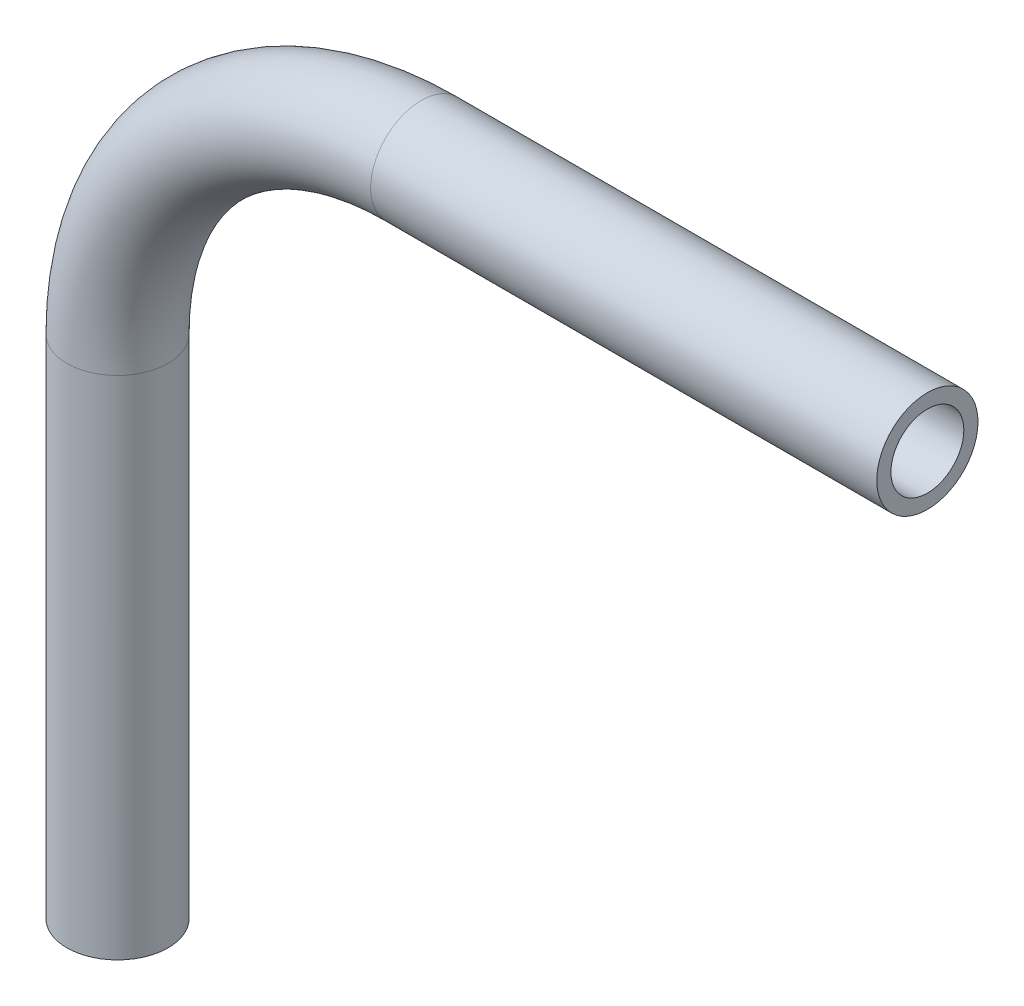
ISO-10303-21;
HEADER;
FILE_DESCRIPTION(('STEP AP214'),'2;1');
FILE_NAME('part.step','',(''),(''),'','','');
FILE_SCHEMA(('AUTOMOTIVE_DESIGN { 1 0 10303 214 1 1 1 1 }'));
ENDSEC;
DATA;
#1=APPLICATION_CONTEXT('core data for automotive mechanical design processes');
#2=APPLICATION_PROTOCOL_DEFINITION('international standard','automotive_design',2000,#1);
#3=PRODUCT_CONTEXT('',#1,'mechanical');
#4=PRODUCT('Part','Part','',(#3));
#5=PRODUCT_RELATED_PRODUCT_CATEGORY('part','',(#4));
#6=PRODUCT_DEFINITION_FORMATION('','',#4);
#7=PRODUCT_DEFINITION_CONTEXT('part definition',#1,'design');
#8=PRODUCT_DEFINITION('design','',#6,#7);
#9=PRODUCT_DEFINITION_SHAPE('','',#8);
#10=(LENGTH_UNIT() NAMED_UNIT(*) SI_UNIT(.MILLI.,.METRE.));
#11=(NAMED_UNIT(*) PLANE_ANGLE_UNIT() SI_UNIT($,.RADIAN.));
#12=(NAMED_UNIT(*) SI_UNIT($,.STERADIAN.) SOLID_ANGLE_UNIT());
#13=UNCERTAINTY_MEASURE_WITH_UNIT(LENGTH_MEASURE(1.E-05),#10,'distance_accuracy_value','');
#14=(GEOMETRIC_REPRESENTATION_CONTEXT(3) GLOBAL_UNCERTAINTY_ASSIGNED_CONTEXT((#13)) GLOBAL_UNIT_ASSIGNED_CONTEXT((#10,
#11,#12)) REPRESENTATION_CONTEXT('',''));
#15=CARTESIAN_POINT('',(0.,0.,0.));
#16=DIRECTION('',(0.,0.,1.));
#17=DIRECTION('',(1.,0.,0.));
#18=AXIS2_PLACEMENT_3D('',#15,#16,#17);
#19=CARTESIAN_POINT('',(1.35308431126191E-13,-33.2723178807936,0.));
#20=DIRECTION('',(0.,1.,0.));
#21=DIRECTION('',(-1.,0.,0.));
#22=AXIS2_PLACEMENT_3D('',#19,#20,#21);
#23=CYLINDRICAL_SURFACE('',#22,3.175);
#24=CARTESIAN_POINT('',(0.,-1.52231788079369,0.));
#25=DIRECTION('',(0.,1.,0.));
#26=DIRECTION('',(0.,0.,-1.));
#27=AXIS2_PLACEMENT_3D('',#24,#25,#26);
#28=CIRCLE('',#27,3.175);
#29=CARTESIAN_POINT('',(-3.17500000000004,-1.52231788079369,0.));
#30=VERTEX_POINT('',#29);
#31=EDGE_CURVE('E81',#30,#30,#28,.T.);
#32=ORIENTED_EDGE('',*,*,#31,.F.);
#33=EDGE_LOOP('',(#32));
#34=FACE_BOUND('',#33,.T.);
#35=CARTESIAN_POINT('',(1.35308431126191E-13,-33.2723178807936,0.));
#36=DIRECTION('',(0.,1.,0.));
#37=DIRECTION('',(0.,0.,-1.));
#38=AXIS2_PLACEMENT_3D('',#35,#36,#37);
#39=CIRCLE('',#38,3.175);
#40=CARTESIAN_POINT('',(1.35308431126191E-13,-33.2723178807936,-3.175));
#41=VERTEX_POINT('',#40);
#42=EDGE_CURVE('E50',#41,#41,#39,.T.);
#43=ORIENTED_EDGE('',*,*,#42,.T.);
#44=EDGE_LOOP('',(#43));
#45=FACE_BOUND('',#44,.T.);
#46=ADVANCED_FACE('F35',(#34,#45),#23,.T.);
#47=CARTESIAN_POINT('',(19.05,-1.52231788079369,0.));
#48=DIRECTION('',(0.,0.,-1.));
#49=DIRECTION('',(-1.,0.,0.));
#50=AXIS2_PLACEMENT_3D('',#47,#48,#49);
#51=TOROIDAL_SURFACE('',#50,19.05,3.175);
#52=CARTESIAN_POINT('',(19.05,17.5276821192064,0.));
#53=DIRECTION('',(1.,0.,0.));
#54=DIRECTION('',(0.,0.,-1.));
#55=AXIS2_PLACEMENT_3D('',#52,#53,#54);
#56=CIRCLE('',#55,3.175);
#57=CARTESIAN_POINT('',(19.05,20.7026821192064,0.));
#58=VERTEX_POINT('',#57);
#59=EDGE_CURVE('E39',#58,#58,#56,.T.);
#60=CARTESIAN_POINT('',(19.05,-1.52231788079369,0.));
#61=DIRECTION('',(0.,0.,-1.));
#62=DIRECTION('',(-1.,0.,0.));
#63=AXIS2_PLACEMENT_3D('',#60,#61,#62);
#64=CIRCLE('',#63,22.225);
#65=EDGE_CURVE('',#30,#58,#64,.T.);
#66=ORIENTED_EDGE('',*,*,#31,.T.);
#67=ORIENTED_EDGE('',*,*,#59,.F.);
#68=ORIENTED_EDGE('',*,*,#65,.T.);
#69=ORIENTED_EDGE('',*,*,#65,.F.);
#70=EDGE_LOOP('',(#66,#68,#67,#69));
#71=FACE_BOUND('',#70,.T.);
#72=ADVANCED_FACE('F89',(#71),#51,.T.);
#73=CARTESIAN_POINT('',(19.05,17.5276821192064,0.));
#74=DIRECTION('',(1.,0.,0.));
#75=DIRECTION('',(0.,1.,0.));
#76=AXIS2_PLACEMENT_3D('',#73,#74,#75);
#77=CYLINDRICAL_SURFACE('',#76,3.175);
#78=CARTESIAN_POINT('',(50.7999999999999,17.5276821192064,0.));
#79=DIRECTION('',(1.,0.,0.));
#80=DIRECTION('',(0.,0.,-1.));
#81=AXIS2_PLACEMENT_3D('',#78,#79,#80);
#82=CIRCLE('',#81,3.175);
#83=CARTESIAN_POINT('',(50.7999999999999,17.5276821192064,-3.175));
#84=VERTEX_POINT('',#83);
#85=EDGE_CURVE('E55',#84,#84,#82,.T.);
#86=ORIENTED_EDGE('',*,*,#85,.F.);
#87=EDGE_LOOP('',(#86));
#88=FACE_BOUND('',#87,.T.);
#89=ORIENTED_EDGE('',*,*,#59,.T.);
#90=EDGE_LOOP('',(#89));
#91=FACE_BOUND('',#90,.T.);
#92=ADVANCED_FACE('F37',(#88,#91),#77,.T.);
#93=CARTESIAN_POINT('',(1.35308431126191E-13,-33.2723178807936,0.));
#94=DIRECTION('',(0.,1.,0.));
#95=DIRECTION('',(0.,0.,-1.));
#96=AXIS2_PLACEMENT_3D('',#93,#94,#95);
#97=PLANE('',#96);
#98=CARTESIAN_POINT('',(1.35308431126191E-13,-33.2723178807936,0.));
#99=DIRECTION('',(0.,1.,0.));
#100=DIRECTION('',(0.,0.,-1.));
#101=AXIS2_PLACEMENT_3D('',#98,#99,#100);
#102=CIRCLE('',#101,2.286);
#103=CARTESIAN_POINT('',(1.35308431126191E-13,-33.2723178807936,-2.286));
#104=VERTEX_POINT('',#103);
#105=EDGE_CURVE('E76',#104,#104,#102,.F.);
#106=ORIENTED_EDGE('',*,*,#105,.F.);
#107=EDGE_LOOP('',(#106));
#108=FACE_BOUND('',#107,.T.);
#109=ORIENTED_EDGE('',*,*,#42,.F.);
#110=EDGE_LOOP('',(#109));
#111=FACE_BOUND('',#110,.T.);
#112=ADVANCED_FACE('F95',(#108,#111),#97,.F.);
#113=CARTESIAN_POINT('',(50.7999999999999,17.5276821192064,0.));
#114=DIRECTION('',(1.,0.,0.));
#115=DIRECTION('',(0.,0.,-1.));
#116=AXIS2_PLACEMENT_3D('',#113,#114,#115);
#117=PLANE('',#116);
#118=CARTESIAN_POINT('',(50.7999999999999,17.5276821192064,0.));
#119=DIRECTION('',(1.,0.,0.));
#120=DIRECTION('',(0.,0.,-1.));
#121=AXIS2_PLACEMENT_3D('',#118,#119,#120);
#122=CIRCLE('',#121,2.286);
#123=CARTESIAN_POINT('',(50.7999999999999,17.5276821192064,-2.286));
#124=VERTEX_POINT('',#123);
#125=EDGE_CURVE('E11',#124,#124,#122,.F.);
#126=ORIENTED_EDGE('',*,*,#125,.T.);
#127=EDGE_LOOP('',(#126));
#128=FACE_BOUND('',#127,.T.);
#129=ORIENTED_EDGE('',*,*,#85,.T.);
#130=EDGE_LOOP('',(#129));
#131=FACE_BOUND('',#130,.T.);
#132=ADVANCED_FACE('F62',(#128,#131),#117,.T.);
#133=CARTESIAN_POINT('',(1.35308431126191E-13,-33.2723178807936,0.));
#134=DIRECTION('',(0.,1.,0.));
#135=DIRECTION('',(-1.,0.,0.));
#136=AXIS2_PLACEMENT_3D('',#133,#134,#135);
#137=CYLINDRICAL_SURFACE('',#136,2.286);
#138=CARTESIAN_POINT('',(0.,-1.52231788079369,0.));
#139=DIRECTION('',(0.,1.,0.));
#140=DIRECTION('',(0.,0.,-1.));
#141=AXIS2_PLACEMENT_3D('',#138,#139,#140);
#142=CIRCLE('',#141,2.286);
#143=CARTESIAN_POINT('',(-2.28600000000003,-1.52231788079369,0.));
#144=VERTEX_POINT('',#143);
#145=EDGE_CURVE('E73',#144,#144,#142,.F.);
#146=ORIENTED_EDGE('',*,*,#145,.F.);
#147=EDGE_LOOP('',(#146));
#148=FACE_BOUND('',#147,.T.);
#149=ORIENTED_EDGE('',*,*,#105,.T.);
#150=EDGE_LOOP('',(#149));
#151=FACE_BOUND('',#150,.T.);
#152=ADVANCED_FACE('F103',(#148,#151),#137,.F.);
#153=CARTESIAN_POINT('',(19.05,-1.52231788079369,0.));
#154=DIRECTION('',(0.,0.,-1.));
#155=DIRECTION('',(-1.,0.,0.));
#156=AXIS2_PLACEMENT_3D('',#153,#154,#155);
#157=TOROIDAL_SURFACE('',#156,19.05,2.286);
#158=CARTESIAN_POINT('',(19.05,17.5276821192064,0.));
#159=DIRECTION('',(1.,0.,0.));
#160=DIRECTION('',(0.,0.,-1.));
#161=AXIS2_PLACEMENT_3D('',#158,#159,#160);
#162=CIRCLE('',#161,2.286);
#163=CARTESIAN_POINT('',(19.05,19.8136821192063,0.));
#164=VERTEX_POINT('',#163);
#165=EDGE_CURVE('E44',#164,#164,#162,.F.);
#166=CARTESIAN_POINT('',(19.05,-1.52231788079369,0.));
#167=DIRECTION('',(0.,0.,-1.));
#168=DIRECTION('',(-1.,0.,0.));
#169=AXIS2_PLACEMENT_3D('',#166,#167,#168);
#170=CIRCLE('',#169,21.336);
#171=EDGE_CURVE('',#144,#164,#170,.T.);
#172=ORIENTED_EDGE('',*,*,#145,.T.);
#173=ORIENTED_EDGE('',*,*,#165,.F.);
#174=ORIENTED_EDGE('',*,*,#171,.T.);
#175=ORIENTED_EDGE('',*,*,#171,.F.);
#176=EDGE_LOOP('',(#172,#174,#173,#175));
#177=FACE_BOUND('',#176,.T.);
#178=ADVANCED_FACE('F68',(#177),#157,.F.);
#179=CARTESIAN_POINT('',(19.05,17.5276821192064,0.));
#180=DIRECTION('',(1.,0.,0.));
#181=DIRECTION('',(0.,1.,0.));
#182=AXIS2_PLACEMENT_3D('',#179,#180,#181);
#183=CYLINDRICAL_SURFACE('',#182,2.286);
#184=ORIENTED_EDGE('',*,*,#125,.F.);
#185=EDGE_LOOP('',(#184));
#186=FACE_BOUND('',#185,.T.);
#187=ORIENTED_EDGE('',*,*,#165,.T.);
#188=EDGE_LOOP('',(#187));
#189=FACE_BOUND('',#188,.T.);
#190=ADVANCED_FACE('F65',(#186,#189),#183,.F.);
#191=CLOSED_SHELL('',(#46,#72,#92,#112,#132,#152,#178,#190));
#192=MANIFOLD_SOLID_BREP('B2',#191);
#193=ADVANCED_BREP_SHAPE_REPRESENTATION('',(#18,#192),#14);
#194=SHAPE_DEFINITION_REPRESENTATION(#9,#193);
ENDSEC;
END-ISO-10303-21;
